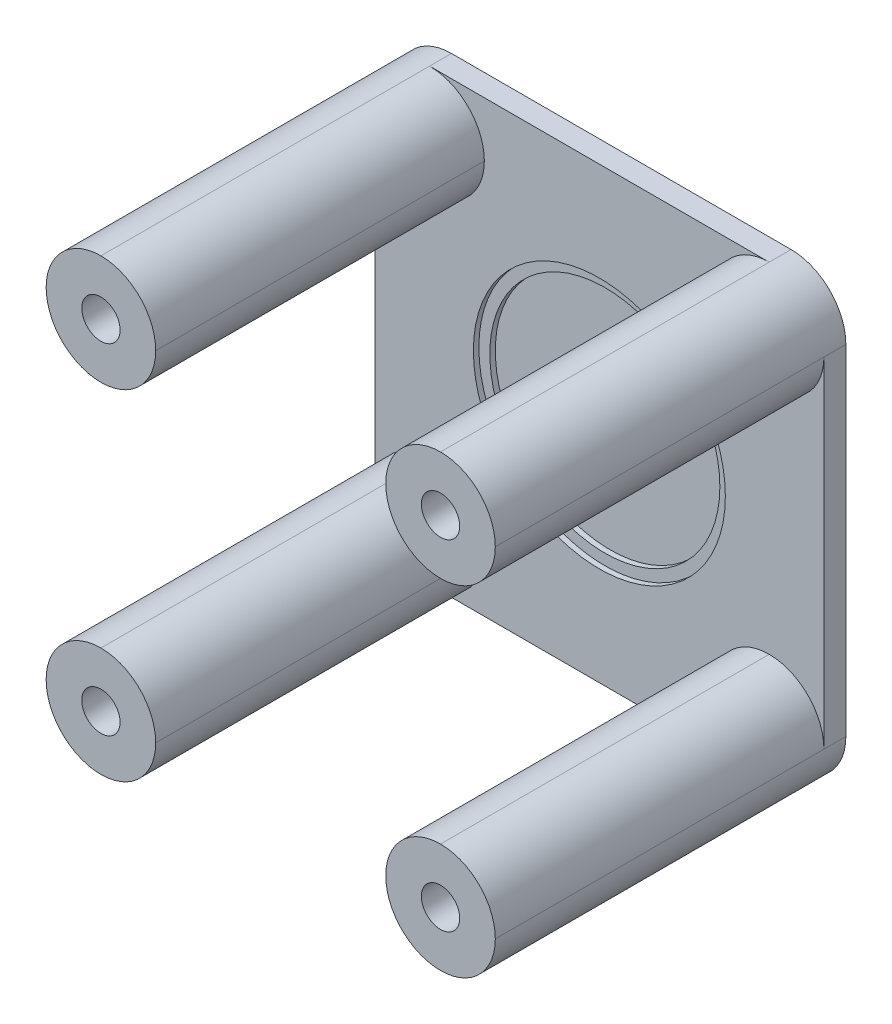
ISO-10303-21;
HEADER;
FILE_DESCRIPTION(('STEP AP214'),'2;1');
FILE_NAME('part.step','',(''),(''),'','','');
FILE_SCHEMA(('AUTOMOTIVE_DESIGN { 1 0 10303 214 1 1 1 1 }'));
ENDSEC;
DATA;
#1=APPLICATION_CONTEXT('core data for automotive mechanical design processes');
#2=APPLICATION_PROTOCOL_DEFINITION('international standard','automotive_design',2000,#1);
#3=PRODUCT_CONTEXT('',#1,'mechanical');
#4=PRODUCT('Part','Part','',(#3));
#5=PRODUCT_RELATED_PRODUCT_CATEGORY('part','',(#4));
#6=PRODUCT_DEFINITION_FORMATION('','',#4);
#7=PRODUCT_DEFINITION_CONTEXT('part definition',#1,'design');
#8=PRODUCT_DEFINITION('design','',#6,#7);
#9=PRODUCT_DEFINITION_SHAPE('','',#8);
#10=(LENGTH_UNIT() NAMED_UNIT(*) SI_UNIT(.MILLI.,.METRE.));
#11=(NAMED_UNIT(*) PLANE_ANGLE_UNIT() SI_UNIT($,.RADIAN.));
#12=(NAMED_UNIT(*) SI_UNIT($,.STERADIAN.) SOLID_ANGLE_UNIT());
#13=UNCERTAINTY_MEASURE_WITH_UNIT(LENGTH_MEASURE(1.E-05),#10,'distance_accuracy_value','');
#14=(GEOMETRIC_REPRESENTATION_CONTEXT(3) GLOBAL_UNCERTAINTY_ASSIGNED_CONTEXT((#13)) GLOBAL_UNIT_ASSIGNED_CONTEXT((#10,
#11,#12)) REPRESENTATION_CONTEXT('',''));
#15=CARTESIAN_POINT('',(0.,0.,0.));
#16=DIRECTION('',(0.,0.,1.));
#17=DIRECTION('',(1.,0.,0.));
#18=AXIS2_PLACEMENT_3D('',#15,#16,#17);
#19=CARTESIAN_POINT('',(-34.5083333333333,4.35624999999999,1.));
#20=DIRECTION('',(0.,0.,1.));
#21=DIRECTION('',(1.,0.,0.));
#22=AXIS2_PLACEMENT_3D('',#19,#20,#21);
#23=CYLINDRICAL_SURFACE('',#22,10.5);
#24=CARTESIAN_POINT('',(-34.5083333333333,4.35624999999999,1.));
#25=DIRECTION('',(0.,0.,1.));
#26=DIRECTION('',(1.,0.,0.));
#27=AXIS2_PLACEMENT_3D('',#24,#25,#26);
#28=CIRCLE('',#27,10.5);
#29=CARTESIAN_POINT('',(-24.0083333333333,4.35624999999999,1.));
#30=VERTEX_POINT('',#29);
#31=EDGE_CURVE('E314',#30,#30,#28,.T.);
#32=ORIENTED_EDGE('',*,*,#31,.F.);
#33=EDGE_LOOP('',(#32));
#34=FACE_BOUND('',#33,.T.);
#35=CARTESIAN_POINT('',(-34.5083333333333,4.35624999999999,1.5));
#36=DIRECTION('',(0.,0.,1.));
#37=DIRECTION('',(1.,0.,0.));
#38=AXIS2_PLACEMENT_3D('',#35,#36,#37);
#39=CIRCLE('',#38,10.5);
#40=CARTESIAN_POINT('',(-24.0083333333333,4.35624999999999,1.5));
#41=VERTEX_POINT('',#40);
#42=EDGE_CURVE('E42',#41,#41,#39,.F.);
#43=ORIENTED_EDGE('',*,*,#42,.F.);
#44=EDGE_LOOP('',(#43));
#45=FACE_BOUND('',#44,.T.);
#46=ADVANCED_FACE('F38',(#34,#45),#23,.F.);
#47=CARTESIAN_POINT('',(-34.5083333333333,4.35624999999999,2.));
#48=DIRECTION('',(0.,0.,-1.));
#49=DIRECTION('',(-1.,0.,0.));
#50=AXIS2_PLACEMENT_3D('',#47,#48,#49);
#51=CYLINDRICAL_SURFACE('',#50,1.25);
#52=CARTESIAN_POINT('',(-34.5083333333333,4.35624999999999,0.));
#53=DIRECTION('',(0.,0.,1.));
#54=DIRECTION('',(1.,0.,0.));
#55=AXIS2_PLACEMENT_3D('',#52,#53,#54);
#56=CIRCLE('',#55,1.25);
#57=CARTESIAN_POINT('',(-33.2583333333333,4.35624999999999,0.));
#58=VERTEX_POINT('',#57);
#59=EDGE_CURVE('E344',#58,#58,#56,.T.);
#60=ORIENTED_EDGE('',*,*,#59,.F.);
#61=EDGE_LOOP('',(#60));
#62=FACE_BOUND('',#61,.T.);
#63=CARTESIAN_POINT('',(-34.5083333333333,4.35624999999999,1.));
#64=DIRECTION('',(0.,0.,1.));
#65=DIRECTION('',(1.,0.,0.));
#66=AXIS2_PLACEMENT_3D('',#63,#64,#65);
#67=CIRCLE('',#66,1.25);
#68=CARTESIAN_POINT('',(-33.2583333333333,4.35624999999999,1.));
#69=VERTEX_POINT('',#68);
#70=EDGE_CURVE('E302',#69,#69,#67,.T.);
#71=ORIENTED_EDGE('',*,*,#70,.T.);
#72=EDGE_LOOP('',(#71));
#73=FACE_BOUND('',#72,.T.);
#74=ADVANCED_FACE('F519',(#62,#73),#51,.F.);
#75=CARTESIAN_POINT('',(0.,0.,2.));
#76=DIRECTION('',(0.,0.,1.));
#77=DIRECTION('',(1.,0.,0.));
#78=AXIS2_PLACEMENT_3D('',#75,#76,#77);
#79=PLANE('',#78);
#80=CARTESIAN_POINT('',(-34.5083333333333,4.35624999999999,2.));
#81=DIRECTION('',(0.,0.,1.));
#82=DIRECTION('',(1.,0.,0.));
#83=AXIS2_PLACEMENT_3D('',#80,#81,#82);
#84=CIRCLE('',#83,11.5);
#85=CARTESIAN_POINT('',(-23.0083333333333,4.35624999999999,2.));
#86=VERTEX_POINT('',#85);
#87=EDGE_CURVE('E327',#86,#86,#84,.T.);
#88=ORIENTED_EDGE('',*,*,#87,.F.);
#89=EDGE_LOOP('',(#88));
#90=FACE_BOUND('',#89,.T.);
#91=CARTESIAN_POINT('',(-19.0083333333333,19.85625,2.));
#92=DIRECTION('',(0.,0.,1.));
#93=DIRECTION('',(1.,0.,0.));
#94=AXIS2_PLACEMENT_3D('',#91,#92,#93);
#95=CIRCLE('',#94,5.);
#96=CARTESIAN_POINT('',(-14.0083333333333,19.85625,2.));
#97=VERTEX_POINT('',#96);
#98=CARTESIAN_POINT('',(-19.0083333333333,14.85625,2.));
#99=VERTEX_POINT('',#98);
#100=EDGE_CURVE('E56',#97,#99,#95,.F.);
#101=ORIENTED_EDGE('',*,*,#100,.T.);
#102=CARTESIAN_POINT('',(-19.0083333333333,19.85625,2.));
#103=DIRECTION('',(0.,0.,1.));
#104=DIRECTION('',(1.,0.,0.));
#105=AXIS2_PLACEMENT_3D('',#102,#103,#104);
#106=CIRCLE('',#105,5.);
#107=CARTESIAN_POINT('',(-24.0083333333333,19.85625,2.));
#108=VERTEX_POINT('',#107);
#109=EDGE_CURVE('E48',#99,#108,#106,.F.);
#110=ORIENTED_EDGE('',*,*,#109,.T.);
#111=CARTESIAN_POINT('',(-19.0083333333333,19.85625,2.));
#112=DIRECTION('',(0.,0.,1.));
#113=DIRECTION('',(1.,0.,0.));
#114=AXIS2_PLACEMENT_3D('',#111,#112,#113);
#115=CIRCLE('',#114,5.);
#116=CARTESIAN_POINT('',(-19.0083333333333,24.85625,2.));
#117=VERTEX_POINT('',#116);
#118=EDGE_CURVE('E218',#108,#117,#115,.F.);
#119=ORIENTED_EDGE('',*,*,#118,.T.);
#120=DIRECTION('',(-1.,0.,0.));
#121=VECTOR('',#120,1.);
#122=CARTESIAN_POINT('',(-55.0083333333333,24.85625,2.));
#123=LINE('',#122,#121);
#124=CARTESIAN_POINT('',(-50.0083333333333,24.85625,2.));
#125=VERTEX_POINT('',#124);
#126=EDGE_CURVE('E184',#117,#125,#123,.T.);
#127=ORIENTED_EDGE('',*,*,#126,.T.);
#128=CARTESIAN_POINT('',(-50.0083333333333,19.85625,2.));
#129=DIRECTION('',(0.,0.,1.));
#130=DIRECTION('',(1.,0.,0.));
#131=AXIS2_PLACEMENT_3D('',#128,#129,#130);
#132=CIRCLE('',#131,5.);
#133=CARTESIAN_POINT('',(-45.0083333333333,19.85625,2.));
#134=VERTEX_POINT('',#133);
#135=EDGE_CURVE('E236',#125,#134,#132,.F.);
#136=ORIENTED_EDGE('',*,*,#135,.T.);
#137=CARTESIAN_POINT('',(-50.0083333333333,19.85625,2.));
#138=DIRECTION('',(0.,0.,1.));
#139=DIRECTION('',(1.,0.,0.));
#140=AXIS2_PLACEMENT_3D('',#137,#138,#139);
#141=CIRCLE('',#140,5.);
#142=CARTESIAN_POINT('',(-50.0083333333333,14.85625,2.));
#143=VERTEX_POINT('',#142);
#144=EDGE_CURVE('E11',#134,#143,#141,.F.);
#145=ORIENTED_EDGE('',*,*,#144,.T.);
#146=CARTESIAN_POINT('',(-50.0083333333333,19.85625,2.));
#147=DIRECTION('',(0.,0.,1.));
#148=DIRECTION('',(1.,0.,0.));
#149=AXIS2_PLACEMENT_3D('',#146,#147,#148);
#150=CIRCLE('',#149,5.);
#151=CARTESIAN_POINT('',(-55.0083333333333,19.85625,2.));
#152=VERTEX_POINT('',#151);
#153=EDGE_CURVE('E232',#143,#152,#150,.F.);
#154=ORIENTED_EDGE('',*,*,#153,.T.);
#155=DIRECTION('',(0.,-1.,0.));
#156=VECTOR('',#155,1.);
#157=CARTESIAN_POINT('',(-55.0083333333333,24.85625,2.));
#158=LINE('',#157,#156);
#159=CARTESIAN_POINT('',(-55.0083333333333,-11.14375,2.));
#160=VERTEX_POINT('',#159);
#161=EDGE_CURVE('E204',#152,#160,#158,.T.);
#162=ORIENTED_EDGE('',*,*,#161,.T.);
#163=CARTESIAN_POINT('',(-50.0083333333333,-11.14375,2.));
#164=DIRECTION('',(0.,0.,1.));
#165=DIRECTION('',(1.,0.,0.));
#166=AXIS2_PLACEMENT_3D('',#163,#164,#165);
#167=CIRCLE('',#166,5.);
#168=CARTESIAN_POINT('',(-50.0083333333333,-6.14375000000001,2.));
#169=VERTEX_POINT('',#168);
#170=EDGE_CURVE('E229',#160,#169,#167,.F.);
#171=ORIENTED_EDGE('',*,*,#170,.T.);
#172=CARTESIAN_POINT('',(-50.0083333333333,-11.14375,2.));
#173=DIRECTION('',(0.,0.,1.));
#174=DIRECTION('',(1.,0.,0.));
#175=AXIS2_PLACEMENT_3D('',#172,#173,#174);
#176=CIRCLE('',#175,5.);
#177=CARTESIAN_POINT('',(-45.0083333333333,-11.14375,2.));
#178=VERTEX_POINT('',#177);
#179=EDGE_CURVE('E63',#169,#178,#176,.F.);
#180=ORIENTED_EDGE('',*,*,#179,.T.);
#181=CARTESIAN_POINT('',(-50.0083333333333,-11.14375,2.));
#182=DIRECTION('',(0.,0.,1.));
#183=DIRECTION('',(1.,0.,0.));
#184=AXIS2_PLACEMENT_3D('',#181,#182,#183);
#185=CIRCLE('',#184,5.);
#186=CARTESIAN_POINT('',(-50.0083333333333,-16.14375,2.));
#187=VERTEX_POINT('',#186);
#188=EDGE_CURVE('E241',#178,#187,#185,.F.);
#189=ORIENTED_EDGE('',*,*,#188,.T.);
#190=DIRECTION('',(1.,0.,0.));
#191=VECTOR('',#190,1.);
#192=CARTESIAN_POINT('',(-55.0083333333333,-16.14375,2.));
#193=LINE('',#192,#191);
#194=CARTESIAN_POINT('',(-19.0083333333333,-16.14375,2.));
#195=VERTEX_POINT('',#194);
#196=EDGE_CURVE('E367',#187,#195,#193,.T.);
#197=ORIENTED_EDGE('',*,*,#196,.T.);
#198=CARTESIAN_POINT('',(-19.0083333333333,-11.14375,2.));
#199=DIRECTION('',(0.,0.,1.));
#200=DIRECTION('',(1.,0.,0.));
#201=AXIS2_PLACEMENT_3D('',#198,#199,#200);
#202=CIRCLE('',#201,5.);
#203=CARTESIAN_POINT('',(-24.0083333333333,-11.14375,2.));
#204=VERTEX_POINT('',#203);
#205=EDGE_CURVE('E244',#195,#204,#202,.F.);
#206=ORIENTED_EDGE('',*,*,#205,.T.);
#207=CARTESIAN_POINT('',(-19.0083333333333,-11.14375,2.));
#208=DIRECTION('',(0.,0.,1.));
#209=DIRECTION('',(1.,0.,0.));
#210=AXIS2_PLACEMENT_3D('',#207,#208,#209);
#211=CIRCLE('',#210,5.);
#212=CARTESIAN_POINT('',(-19.0083333333333,-6.14375000000001,2.));
#213=VERTEX_POINT('',#212);
#214=EDGE_CURVE('E225',#204,#213,#211,.F.);
#215=ORIENTED_EDGE('',*,*,#214,.T.);
#216=CARTESIAN_POINT('',(-19.0083333333333,-11.14375,2.));
#217=DIRECTION('',(0.,0.,1.));
#218=DIRECTION('',(1.,0.,0.));
#219=AXIS2_PLACEMENT_3D('',#216,#217,#218);
#220=CIRCLE('',#219,5.);
#221=CARTESIAN_POINT('',(-14.0083333333333,-11.14375,2.));
#222=VERTEX_POINT('',#221);
#223=EDGE_CURVE('E247',#213,#222,#220,.F.);
#224=ORIENTED_EDGE('',*,*,#223,.T.);
#225=DIRECTION('',(0.,1.,0.));
#226=VECTOR('',#225,1.);
#227=CARTESIAN_POINT('',(-14.0083333333333,24.85625,2.));
#228=LINE('',#227,#226);
#229=EDGE_CURVE('E370',#222,#97,#228,.T.);
#230=ORIENTED_EDGE('',*,*,#229,.T.);
#231=EDGE_LOOP('',(#101,#110,#119,#127,#136,#145,#154,#162,#171,#180,#189,#197,#206,#215,#224,#230));
#232=FACE_BOUND('',#231,.T.);
#233=ADVANCED_FACE('F491',(#90,#232),#79,.T.);
#234=CARTESIAN_POINT('',(0.,0.,0.));
#235=DIRECTION('',(0.,0.,1.));
#236=DIRECTION('',(1.,0.,0.));
#237=AXIS2_PLACEMENT_3D('',#234,#235,#236);
#238=PLANE('',#237);
#239=DIRECTION('',(0.,1.,0.));
#240=VECTOR('',#239,1.);
#241=CARTESIAN_POINT('',(-14.0083333333333,24.85625,0.));
#242=LINE('',#241,#240);
#243=CARTESIAN_POINT('',(-14.0083333333333,-11.14375,0.));
#244=VERTEX_POINT('',#243);
#245=CARTESIAN_POINT('',(-14.0083333333333,19.85625,0.));
#246=VERTEX_POINT('',#245);
#247=EDGE_CURVE('E205',#244,#246,#242,.T.);
#248=ORIENTED_EDGE('',*,*,#247,.F.);
#249=CARTESIAN_POINT('',(-19.0083333333333,-11.14375,0.));
#250=DIRECTION('',(0.,0.,1.));
#251=DIRECTION('',(1.,0.,0.));
#252=AXIS2_PLACEMENT_3D('',#249,#250,#251);
#253=CIRCLE('',#252,5.);
#254=CARTESIAN_POINT('',(-19.0083333333333,-16.14375,0.));
#255=VERTEX_POINT('',#254);
#256=EDGE_CURVE('E213',#244,#255,#253,.F.);
#257=ORIENTED_EDGE('',*,*,#256,.T.);
#258=DIRECTION('',(1.,0.,0.));
#259=VECTOR('',#258,1.);
#260=CARTESIAN_POINT('',(-55.0083333333333,-16.14375,0.));
#261=LINE('',#260,#259);
#262=CARTESIAN_POINT('',(-50.0083333333333,-16.14375,0.));
#263=VERTEX_POINT('',#262);
#264=EDGE_CURVE('E378',#263,#255,#261,.T.);
#265=ORIENTED_EDGE('',*,*,#264,.F.);
#266=CARTESIAN_POINT('',(-50.0083333333333,-11.14375,0.));
#267=DIRECTION('',(0.,0.,1.));
#268=DIRECTION('',(1.,0.,0.));
#269=AXIS2_PLACEMENT_3D('',#266,#267,#268);
#270=CIRCLE('',#269,5.);
#271=CARTESIAN_POINT('',(-55.0083333333333,-11.14375,0.));
#272=VERTEX_POINT('',#271);
#273=EDGE_CURVE('E214',#263,#272,#270,.F.);
#274=ORIENTED_EDGE('',*,*,#273,.T.);
#275=DIRECTION('',(0.,-1.,0.));
#276=VECTOR('',#275,1.);
#277=CARTESIAN_POINT('',(-55.0083333333333,24.85625,0.));
#278=LINE('',#277,#276);
#279=CARTESIAN_POINT('',(-55.0083333333333,19.85625,0.));
#280=VERTEX_POINT('',#279);
#281=EDGE_CURVE('E364',#280,#272,#278,.T.);
#282=ORIENTED_EDGE('',*,*,#281,.F.);
#283=CARTESIAN_POINT('',(-50.0083333333333,19.85625,0.));
#284=DIRECTION('',(0.,0.,1.));
#285=DIRECTION('',(1.,0.,0.));
#286=AXIS2_PLACEMENT_3D('',#283,#284,#285);
#287=CIRCLE('',#286,5.);
#288=CARTESIAN_POINT('',(-50.0083333333333,24.85625,0.));
#289=VERTEX_POINT('',#288);
#290=EDGE_CURVE('E202',#280,#289,#287,.F.);
#291=ORIENTED_EDGE('',*,*,#290,.T.);
#292=DIRECTION('',(-1.,0.,0.));
#293=VECTOR('',#292,1.);
#294=CARTESIAN_POINT('',(-55.0083333333333,24.85625,0.));
#295=LINE('',#294,#293);
#296=CARTESIAN_POINT('',(-19.0083333333333,24.85625,0.));
#297=VERTEX_POINT('',#296);
#298=EDGE_CURVE('E182',#297,#289,#295,.T.);
#299=ORIENTED_EDGE('',*,*,#298,.F.);
#300=CARTESIAN_POINT('',(-19.0083333333333,19.85625,0.));
#301=DIRECTION('',(0.,0.,1.));
#302=DIRECTION('',(1.,0.,0.));
#303=AXIS2_PLACEMENT_3D('',#300,#301,#302);
#304=CIRCLE('',#303,5.);
#305=EDGE_CURVE('E198',#297,#246,#304,.F.);
#306=ORIENTED_EDGE('',*,*,#305,.T.);
#307=EDGE_LOOP('',(#248,#257,#265,#274,#282,#291,#299,#306));
#308=FACE_BOUND('',#307,.T.);
#309=CARTESIAN_POINT('',(-50.0083333333333,19.85625,0.));
#310=DIRECTION('',(0.,0.,1.));
#311=DIRECTION('',(1.,0.,0.));
#312=AXIS2_PLACEMENT_3D('',#309,#310,#311);
#313=CIRCLE('',#312,1.75);
#314=CARTESIAN_POINT('',(-48.2583333333333,19.85625,0.));
#315=VERTEX_POINT('',#314);
#316=EDGE_CURVE('E360',#315,#315,#313,.T.);
#317=ORIENTED_EDGE('',*,*,#316,.T.);
#318=EDGE_LOOP('',(#317));
#319=FACE_BOUND('',#318,.T.);
#320=CARTESIAN_POINT('',(-50.0083333333333,-11.14375,0.));
#321=DIRECTION('',(0.,0.,1.));
#322=DIRECTION('',(1.,0.,0.));
#323=AXIS2_PLACEMENT_3D('',#320,#321,#322);
#324=CIRCLE('',#323,1.75);
#325=CARTESIAN_POINT('',(-48.2583333333333,-11.14375,0.));
#326=VERTEX_POINT('',#325);
#327=EDGE_CURVE('E356',#326,#326,#324,.T.);
#328=ORIENTED_EDGE('',*,*,#327,.T.);
#329=EDGE_LOOP('',(#328));
#330=FACE_BOUND('',#329,.T.);
#331=CARTESIAN_POINT('',(-19.0083333333333,-11.14375,0.));
#332=DIRECTION('',(0.,0.,1.));
#333=DIRECTION('',(1.,0.,0.));
#334=AXIS2_PLACEMENT_3D('',#331,#332,#333);
#335=CIRCLE('',#334,1.75);
#336=CARTESIAN_POINT('',(-17.2583333333333,-11.14375,0.));
#337=VERTEX_POINT('',#336);
#338=EDGE_CURVE('E352',#337,#337,#335,.T.);
#339=ORIENTED_EDGE('',*,*,#338,.T.);
#340=EDGE_LOOP('',(#339));
#341=FACE_BOUND('',#340,.T.);
#342=CARTESIAN_POINT('',(-19.0083333333333,19.85625,0.));
#343=DIRECTION('',(0.,0.,1.));
#344=DIRECTION('',(1.,0.,0.));
#345=AXIS2_PLACEMENT_3D('',#342,#343,#344);
#346=CIRCLE('',#345,1.75);
#347=CARTESIAN_POINT('',(-17.2583333333333,19.85625,0.));
#348=VERTEX_POINT('',#347);
#349=EDGE_CURVE('E348',#348,#348,#346,.T.);
#350=ORIENTED_EDGE('',*,*,#349,.T.);
#351=EDGE_LOOP('',(#350));
#352=FACE_BOUND('',#351,.T.);
#353=ORIENTED_EDGE('',*,*,#59,.T.);
#354=EDGE_LOOP('',(#353));
#355=FACE_BOUND('',#354,.T.);
#356=ADVANCED_FACE('F196',(#308,#319,#330,#341,#352,#355),#238,.F.);
#357=CARTESIAN_POINT('',(-55.0083333333333,24.85625,2.));
#358=DIRECTION('',(1.,0.,0.));
#359=DIRECTION('',(0.,1.,0.));
#360=AXIS2_PLACEMENT_3D('',#357,#358,#359);
#361=PLANE('',#360);
#362=DIRECTION('',(0.,0.,-1.));
#363=VECTOR('',#362,1.);
#364=CARTESIAN_POINT('',(-55.0083333333333,-11.14375,2.));
#365=LINE('',#364,#363);
#366=EDGE_CURVE('E414',#272,#160,#365,.F.);
#367=ORIENTED_EDGE('',*,*,#366,.T.);
#368=ORIENTED_EDGE('',*,*,#161,.F.);
#369=DIRECTION('',(0.,0.,-1.));
#370=VECTOR('',#369,1.);
#371=CARTESIAN_POINT('',(-55.0083333333333,19.85625,2.));
#372=LINE('',#371,#370);
#373=EDGE_CURVE('E411',#152,#280,#372,.T.);
#374=ORIENTED_EDGE('',*,*,#373,.T.);
#375=ORIENTED_EDGE('',*,*,#281,.T.);
#376=EDGE_LOOP('',(#367,#368,#374,#375));
#377=FACE_BOUND('',#376,.T.);
#378=ADVANCED_FACE('F479',(#377),#361,.F.);
#379=CARTESIAN_POINT('',(-55.0083333333333,-16.14375,2.));
#380=DIRECTION('',(0.,1.,0.));
#381=DIRECTION('',(0.,0.,1.));
#382=AXIS2_PLACEMENT_3D('',#379,#380,#381);
#383=PLANE('',#382);
#384=DIRECTION('',(0.,0.,-1.));
#385=VECTOR('',#384,1.);
#386=CARTESIAN_POINT('',(-19.0083333333333,-16.14375,2.));
#387=LINE('',#386,#385);
#388=EDGE_CURVE('E447',#255,#195,#387,.F.);
#389=ORIENTED_EDGE('',*,*,#388,.T.);
#390=ORIENTED_EDGE('',*,*,#196,.F.);
#391=DIRECTION('',(0.,0.,-1.));
#392=VECTOR('',#391,1.);
#393=CARTESIAN_POINT('',(-50.0083333333333,-16.14375,2.));
#394=LINE('',#393,#392);
#395=EDGE_CURVE('E444',#187,#263,#394,.T.);
#396=ORIENTED_EDGE('',*,*,#395,.T.);
#397=ORIENTED_EDGE('',*,*,#264,.T.);
#398=EDGE_LOOP('',(#389,#390,#396,#397));
#399=FACE_BOUND('',#398,.T.);
#400=ADVANCED_FACE('F469',(#399),#383,.F.);
#401=CARTESIAN_POINT('',(-14.0083333333333,24.85625,2.));
#402=DIRECTION('',(-1.,0.,0.));
#403=DIRECTION('',(0.,-1.,0.));
#404=AXIS2_PLACEMENT_3D('',#401,#402,#403);
#405=PLANE('',#404);
#406=ORIENTED_EDGE('',*,*,#229,.F.);
#407=DIRECTION('',(0.,0.,-1.));
#408=VECTOR('',#407,1.);
#409=CARTESIAN_POINT('',(-14.0083333333333,-11.14375,2.));
#410=LINE('',#409,#408);
#411=EDGE_CURVE('E453',#222,#244,#410,.T.);
#412=ORIENTED_EDGE('',*,*,#411,.T.);
#413=ORIENTED_EDGE('',*,*,#247,.T.);
#414=DIRECTION('',(0.,0.,-1.));
#415=VECTOR('',#414,1.);
#416=CARTESIAN_POINT('',(-14.0083333333333,19.85625,2.));
#417=LINE('',#416,#415);
#418=EDGE_CURVE('E211',#246,#97,#417,.F.);
#419=ORIENTED_EDGE('',*,*,#418,.T.);
#420=EDGE_LOOP('',(#406,#412,#413,#419));
#421=FACE_BOUND('',#420,.T.);
#422=ADVANCED_FACE('F458',(#421),#405,.F.);
#423=CARTESIAN_POINT('',(-55.0083333333333,24.85625,2.));
#424=DIRECTION('',(0.,-1.,0.));
#425=DIRECTION('',(0.,0.,-1.));
#426=AXIS2_PLACEMENT_3D('',#423,#424,#425);
#427=PLANE('',#426);
#428=ORIENTED_EDGE('',*,*,#126,.F.);
#429=DIRECTION('',(0.,0.,-1.));
#430=VECTOR('',#429,1.);
#431=CARTESIAN_POINT('',(-19.0083333333333,24.85625,2.));
#432=LINE('',#431,#430);
#433=EDGE_CURVE('E178',#117,#297,#432,.T.);
#434=ORIENTED_EDGE('',*,*,#433,.T.);
#435=ORIENTED_EDGE('',*,*,#298,.T.);
#436=DIRECTION('',(0.,0.,-1.));
#437=VECTOR('',#436,1.);
#438=CARTESIAN_POINT('',(-50.0083333333333,24.85625,2.));
#439=LINE('',#438,#437);
#440=EDGE_CURVE('E192',#289,#125,#439,.F.);
#441=ORIENTED_EDGE('',*,*,#440,.T.);
#442=EDGE_LOOP('',(#428,#434,#435,#441));
#443=FACE_BOUND('',#442,.T.);
#444=ADVANCED_FACE('F180',(#443),#427,.F.);
#445=CARTESIAN_POINT('',(-50.0083333333333,19.85625,2.));
#446=DIRECTION('',(0.,0.,-1.));
#447=DIRECTION('',(-1.,0.,0.));
#448=AXIS2_PLACEMENT_3D('',#445,#446,#447);
#449=CYLINDRICAL_SURFACE('',#448,1.75);
#450=ORIENTED_EDGE('',*,*,#316,.F.);
#451=EDGE_LOOP('',(#450));
#452=FACE_BOUND('',#451,.T.);
#453=CARTESIAN_POINT('',(-50.0083333333333,19.85625,32.));
#454=DIRECTION('',(0.,0.,1.));
#455=DIRECTION('',(1.,0.,0.));
#456=AXIS2_PLACEMENT_3D('',#453,#454,#455);
#457=CIRCLE('',#456,1.75);
#458=CARTESIAN_POINT('',(-48.2583333333333,19.85625,32.));
#459=VERTEX_POINT('',#458);
#460=EDGE_CURVE('E340',#459,#459,#457,.T.);
#461=ORIENTED_EDGE('',*,*,#460,.T.);
#462=EDGE_LOOP('',(#461));
#463=FACE_BOUND('',#462,.T.);
#464=ADVANCED_FACE('F559',(#452,#463),#449,.F.);
#465=CARTESIAN_POINT('',(-50.0083333333333,-11.14375,2.));
#466=DIRECTION('',(0.,0.,-1.));
#467=DIRECTION('',(-1.,0.,0.));
#468=AXIS2_PLACEMENT_3D('',#465,#466,#467);
#469=CYLINDRICAL_SURFACE('',#468,1.75);
#470=ORIENTED_EDGE('',*,*,#327,.F.);
#471=EDGE_LOOP('',(#470));
#472=FACE_BOUND('',#471,.T.);
#473=CARTESIAN_POINT('',(-50.0083333333333,-11.14375,32.));
#474=DIRECTION('',(0.,0.,1.));
#475=DIRECTION('',(1.,0.,0.));
#476=AXIS2_PLACEMENT_3D('',#473,#474,#475);
#477=CIRCLE('',#476,1.75);
#478=CARTESIAN_POINT('',(-48.2583333333333,-11.14375,32.));
#479=VERTEX_POINT('',#478);
#480=EDGE_CURVE('E336',#479,#479,#477,.T.);
#481=ORIENTED_EDGE('',*,*,#480,.T.);
#482=EDGE_LOOP('',(#481));
#483=FACE_BOUND('',#482,.T.);
#484=ADVANCED_FACE('F555',(#472,#483),#469,.F.);
#485=CARTESIAN_POINT('',(-19.0083333333333,-11.14375,2.));
#486=DIRECTION('',(0.,0.,-1.));
#487=DIRECTION('',(-1.,0.,0.));
#488=AXIS2_PLACEMENT_3D('',#485,#486,#487);
#489=CYLINDRICAL_SURFACE('',#488,1.75);
#490=ORIENTED_EDGE('',*,*,#338,.F.);
#491=EDGE_LOOP('',(#490));
#492=FACE_BOUND('',#491,.T.);
#493=CARTESIAN_POINT('',(-19.0083333333333,-11.14375,32.));
#494=DIRECTION('',(0.,0.,1.));
#495=DIRECTION('',(1.,0.,0.));
#496=AXIS2_PLACEMENT_3D('',#493,#494,#495);
#497=CIRCLE('',#496,1.75);
#498=CARTESIAN_POINT('',(-17.2583333333333,-11.14375,32.));
#499=VERTEX_POINT('',#498);
#500=EDGE_CURVE('E332',#499,#499,#497,.T.);
#501=ORIENTED_EDGE('',*,*,#500,.T.);
#502=EDGE_LOOP('',(#501));
#503=FACE_BOUND('',#502,.T.);
#504=ADVANCED_FACE('F551',(#492,#503),#489,.F.);
#505=CARTESIAN_POINT('',(-19.0083333333333,19.85625,2.));
#506=DIRECTION('',(0.,0.,-1.));
#507=DIRECTION('',(-1.,0.,0.));
#508=AXIS2_PLACEMENT_3D('',#505,#506,#507);
#509=CYLINDRICAL_SURFACE('',#508,1.75);
#510=ORIENTED_EDGE('',*,*,#349,.F.);
#511=EDGE_LOOP('',(#510));
#512=FACE_BOUND('',#511,.T.);
#513=CARTESIAN_POINT('',(-19.0083333333333,19.85625,32.));
#514=DIRECTION('',(0.,0.,1.));
#515=DIRECTION('',(1.,0.,0.));
#516=AXIS2_PLACEMENT_3D('',#513,#514,#515);
#517=CIRCLE('',#516,1.75);
#518=CARTESIAN_POINT('',(-17.2583333333333,19.85625,32.));
#519=VERTEX_POINT('',#518);
#520=EDGE_CURVE('E269',#519,#519,#517,.T.);
#521=ORIENTED_EDGE('',*,*,#520,.T.);
#522=EDGE_LOOP('',(#521));
#523=FACE_BOUND('',#522,.T.);
#524=ADVANCED_FACE('F546',(#512,#523),#509,.F.);
#525=CARTESIAN_POINT('',(0.,0.,32.));
#526=DIRECTION('',(0.,0.,1.));
#527=DIRECTION('',(1.,0.,0.));
#528=AXIS2_PLACEMENT_3D('',#525,#526,#527);
#529=PLANE('',#528);
#530=CARTESIAN_POINT('',(-50.0083333333333,19.85625,32.));
#531=DIRECTION('',(0.,0.,1.));
#532=DIRECTION('',(1.,0.,0.));
#533=AXIS2_PLACEMENT_3D('',#530,#531,#532);
#534=CIRCLE('',#533,5.);
#535=CARTESIAN_POINT('',(-55.0083333333333,19.85625,32.));
#536=VERTEX_POINT('',#535);
#537=CARTESIAN_POINT('',(-50.0083333333333,14.85625,32.));
#538=VERTEX_POINT('',#537);
#539=EDGE_CURVE('E437',#536,#538,#534,.T.);
#540=ORIENTED_EDGE('',*,*,#539,.T.);
#541=CARTESIAN_POINT('',(-50.0083333333333,19.85625,32.));
#542=DIRECTION('',(0.,0.,1.));
#543=DIRECTION('',(1.,0.,0.));
#544=AXIS2_PLACEMENT_3D('',#541,#542,#543);
#545=CIRCLE('',#544,5.);
#546=CARTESIAN_POINT('',(-45.0083333333333,19.85625,32.));
#547=VERTEX_POINT('',#546);
#548=EDGE_CURVE('E441',#538,#547,#545,.T.);
#549=ORIENTED_EDGE('',*,*,#548,.T.);
#550=CARTESIAN_POINT('',(-50.0083333333333,19.85625,32.));
#551=DIRECTION('',(0.,0.,1.));
#552=DIRECTION('',(1.,0.,0.));
#553=AXIS2_PLACEMENT_3D('',#550,#551,#552);
#554=CIRCLE('',#553,5.);
#555=CARTESIAN_POINT('',(-50.0083333333333,24.85625,32.));
#556=VERTEX_POINT('',#555);
#557=EDGE_CURVE('E434',#547,#556,#554,.T.);
#558=ORIENTED_EDGE('',*,*,#557,.T.);
#559=CARTESIAN_POINT('',(-50.0083333333333,19.85625,32.));
#560=DIRECTION('',(0.,0.,1.));
#561=DIRECTION('',(1.,0.,0.));
#562=AXIS2_PLACEMENT_3D('',#559,#560,#561);
#563=CIRCLE('',#562,5.);
#564=EDGE_CURVE('E431',#556,#536,#563,.T.);
#565=ORIENTED_EDGE('',*,*,#564,.T.);
#566=EDGE_LOOP('',(#540,#549,#558,#565));
#567=FACE_BOUND('',#566,.T.);
#568=ORIENTED_EDGE('',*,*,#460,.F.);
#569=EDGE_LOOP('',(#568));
#570=FACE_BOUND('',#569,.T.);
#571=ADVANCED_FACE('F543',(#567,#570),#529,.T.);
#572=CARTESIAN_POINT('',(0.,0.,32.));
#573=DIRECTION('',(0.,0.,-1.));
#574=DIRECTION('',(-1.,0.,0.));
#575=AXIS2_PLACEMENT_3D('',#572,#573,#574);
#576=PLANE('',#575);
#577=CARTESIAN_POINT('',(-50.0083333333333,-11.14375,32.));
#578=DIRECTION('',(0.,0.,-1.));
#579=DIRECTION('',(-1.,0.,0.));
#580=AXIS2_PLACEMENT_3D('',#577,#578,#579);
#581=CIRCLE('',#580,5.);
#582=CARTESIAN_POINT('',(-45.0083333333333,-11.14375,32.));
#583=VERTEX_POINT('',#582);
#584=CARTESIAN_POINT('',(-50.0083333333333,-6.14375000000001,32.));
#585=VERTEX_POINT('',#584);
#586=EDGE_CURVE('E424',#583,#585,#581,.F.);
#587=ORIENTED_EDGE('',*,*,#586,.T.);
#588=CARTESIAN_POINT('',(-50.0083333333333,-11.14375,32.));
#589=DIRECTION('',(0.,0.,-1.));
#590=DIRECTION('',(-1.,0.,0.));
#591=AXIS2_PLACEMENT_3D('',#588,#589,#590);
#592=CIRCLE('',#591,5.);
#593=CARTESIAN_POINT('',(-55.0083333333333,-11.14375,32.));
#594=VERTEX_POINT('',#593);
#595=EDGE_CURVE('E427',#585,#594,#592,.F.);
#596=ORIENTED_EDGE('',*,*,#595,.T.);
#597=CARTESIAN_POINT('',(-50.0083333333333,-11.14375,32.));
#598=DIRECTION('',(0.,0.,-1.));
#599=DIRECTION('',(-1.,0.,0.));
#600=AXIS2_PLACEMENT_3D('',#597,#598,#599);
#601=CIRCLE('',#600,5.);
#602=CARTESIAN_POINT('',(-50.0083333333333,-16.14375,32.));
#603=VERTEX_POINT('',#602);
#604=EDGE_CURVE('E418',#594,#603,#601,.F.);
#605=ORIENTED_EDGE('',*,*,#604,.T.);
#606=CARTESIAN_POINT('',(-50.0083333333333,-11.14375,32.));
#607=DIRECTION('',(0.,0.,-1.));
#608=DIRECTION('',(-1.,0.,0.));
#609=AXIS2_PLACEMENT_3D('',#606,#607,#608);
#610=CIRCLE('',#609,5.);
#611=EDGE_CURVE('E421',#603,#583,#610,.F.);
#612=ORIENTED_EDGE('',*,*,#611,.T.);
#613=EDGE_LOOP('',(#587,#596,#605,#612));
#614=FACE_BOUND('',#613,.T.);
#615=ORIENTED_EDGE('',*,*,#480,.F.);
#616=EDGE_LOOP('',(#615));
#617=FACE_BOUND('',#616,.T.);
#618=ADVANCED_FACE('F539',(#614,#617),#576,.F.);
#619=CARTESIAN_POINT('',(0.,0.,32.));
#620=DIRECTION('',(0.,0.,1.));
#621=DIRECTION('',(1.,0.,0.));
#622=AXIS2_PLACEMENT_3D('',#619,#620,#621);
#623=PLANE('',#622);
#624=CARTESIAN_POINT('',(-19.0083333333333,-11.14375,32.));
#625=DIRECTION('',(0.,0.,1.));
#626=DIRECTION('',(1.,0.,0.));
#627=AXIS2_PLACEMENT_3D('',#624,#625,#626);
#628=CIRCLE('',#627,5.);
#629=CARTESIAN_POINT('',(-14.0083333333333,-11.14375,32.));
#630=VERTEX_POINT('',#629);
#631=CARTESIAN_POINT('',(-19.0083333333333,-6.14375000000001,32.));
#632=VERTEX_POINT('',#631);
#633=EDGE_CURVE('E401',#630,#632,#628,.T.);
#634=ORIENTED_EDGE('',*,*,#633,.T.);
#635=CARTESIAN_POINT('',(-19.0083333333333,-11.14375,32.));
#636=DIRECTION('',(0.,0.,1.));
#637=DIRECTION('',(1.,0.,0.));
#638=AXIS2_PLACEMENT_3D('',#635,#636,#637);
#639=CIRCLE('',#638,5.);
#640=CARTESIAN_POINT('',(-24.0083333333333,-11.14375,32.));
#641=VERTEX_POINT('',#640);
#642=EDGE_CURVE('E407',#632,#641,#639,.T.);
#643=ORIENTED_EDGE('',*,*,#642,.T.);
#644=CARTESIAN_POINT('',(-19.0083333333333,-11.14375,32.));
#645=DIRECTION('',(0.,0.,1.));
#646=DIRECTION('',(1.,0.,0.));
#647=AXIS2_PLACEMENT_3D('',#644,#645,#646);
#648=CIRCLE('',#647,5.);
#649=CARTESIAN_POINT('',(-19.0083333333333,-16.14375,32.));
#650=VERTEX_POINT('',#649);
#651=EDGE_CURVE('E404',#641,#650,#648,.T.);
#652=ORIENTED_EDGE('',*,*,#651,.T.);
#653=CARTESIAN_POINT('',(-19.0083333333333,-11.14375,32.));
#654=DIRECTION('',(0.,0.,1.));
#655=DIRECTION('',(1.,0.,0.));
#656=AXIS2_PLACEMENT_3D('',#653,#654,#655);
#657=CIRCLE('',#656,5.);
#658=EDGE_CURVE('E398',#650,#630,#657,.T.);
#659=ORIENTED_EDGE('',*,*,#658,.T.);
#660=EDGE_LOOP('',(#634,#643,#652,#659));
#661=FACE_BOUND('',#660,.T.);
#662=ORIENTED_EDGE('',*,*,#500,.F.);
#663=EDGE_LOOP('',(#662));
#664=FACE_BOUND('',#663,.T.);
#665=ADVANCED_FACE('F536',(#661,#664),#623,.T.);
#666=CARTESIAN_POINT('',(0.,0.,32.));
#667=DIRECTION('',(0.,0.,-1.));
#668=DIRECTION('',(-1.,0.,0.));
#669=AXIS2_PLACEMENT_3D('',#666,#667,#668);
#670=PLANE('',#669);
#671=CARTESIAN_POINT('',(-19.0083333333333,19.85625,32.));
#672=DIRECTION('',(0.,0.,-1.));
#673=DIRECTION('',(-1.,0.,0.));
#674=AXIS2_PLACEMENT_3D('',#671,#672,#673);
#675=CIRCLE('',#674,5.);
#676=CARTESIAN_POINT('',(-19.0083333333333,24.85625,32.));
#677=VERTEX_POINT('',#676);
#678=CARTESIAN_POINT('',(-24.0083333333333,19.85625,32.));
#679=VERTEX_POINT('',#678);
#680=EDGE_CURVE('E391',#677,#679,#675,.F.);
#681=ORIENTED_EDGE('',*,*,#680,.T.);
#682=CARTESIAN_POINT('',(-19.0083333333333,19.85625,32.));
#683=DIRECTION('',(0.,0.,-1.));
#684=DIRECTION('',(-1.,0.,0.));
#685=AXIS2_PLACEMENT_3D('',#682,#683,#684);
#686=CIRCLE('',#685,5.);
#687=CARTESIAN_POINT('',(-19.0083333333333,14.85625,32.));
#688=VERTEX_POINT('',#687);
#689=EDGE_CURVE('E395',#679,#688,#686,.F.);
#690=ORIENTED_EDGE('',*,*,#689,.T.);
#691=CARTESIAN_POINT('',(-19.0083333333333,19.85625,32.));
#692=DIRECTION('',(0.,0.,-1.));
#693=DIRECTION('',(-1.,0.,0.));
#694=AXIS2_PLACEMENT_3D('',#691,#692,#693);
#695=CIRCLE('',#694,5.);
#696=CARTESIAN_POINT('',(-14.0083333333333,19.85625,32.));
#697=VERTEX_POINT('',#696);
#698=EDGE_CURVE('E388',#688,#697,#695,.F.);
#699=ORIENTED_EDGE('',*,*,#698,.T.);
#700=CARTESIAN_POINT('',(-19.0083333333333,19.85625,32.));
#701=DIRECTION('',(0.,0.,-1.));
#702=DIRECTION('',(-1.,0.,0.));
#703=AXIS2_PLACEMENT_3D('',#700,#701,#702);
#704=CIRCLE('',#703,5.);
#705=EDGE_CURVE('E191',#697,#677,#704,.F.);
#706=ORIENTED_EDGE('',*,*,#705,.T.);
#707=EDGE_LOOP('',(#681,#690,#699,#706));
#708=FACE_BOUND('',#707,.T.);
#709=ORIENTED_EDGE('',*,*,#520,.F.);
#710=EDGE_LOOP('',(#709));
#711=FACE_BOUND('',#710,.T.);
#712=ADVANCED_FACE('F503',(#708,#711),#670,.F.);
#713=CARTESIAN_POINT('',(-19.0083333333333,19.85625,2.));
#714=DIRECTION('',(0.,0.,-1.));
#715=DIRECTION('',(-1.,0.,0.));
#716=AXIS2_PLACEMENT_3D('',#713,#714,#715);
#717=CYLINDRICAL_SURFACE('',#716,5.);
#718=DIRECTION('',(0.,0.,-1.));
#719=VECTOR('',#718,1.);
#720=CARTESIAN_POINT('',(-19.0083333333333,14.85625,32.));
#721=LINE('',#720,#719);
#722=EDGE_CURVE('E262',#99,#688,#721,.F.);
#723=ORIENTED_EDGE('',*,*,#722,.F.);
#724=ORIENTED_EDGE('',*,*,#100,.F.);
#725=DIRECTION('',(0.,0.,-1.));
#726=VECTOR('',#725,1.);
#727=CARTESIAN_POINT('',(-14.0083333333333,19.85625,2.));
#728=LINE('',#727,#726);
#729=EDGE_CURVE('E266',#697,#97,#728,.T.);
#730=ORIENTED_EDGE('',*,*,#729,.F.);
#731=ORIENTED_EDGE('',*,*,#698,.F.);
#732=EDGE_LOOP('',(#723,#724,#730,#731));
#733=FACE_BOUND('',#732,.T.);
#734=ADVANCED_FACE('F507',(#733),#717,.T.);
#735=CARTESIAN_POINT('',(-19.0083333333333,19.85625,2.));
#736=DIRECTION('',(0.,0.,-1.));
#737=DIRECTION('',(-1.,0.,0.));
#738=AXIS2_PLACEMENT_3D('',#735,#736,#737);
#739=CYLINDRICAL_SURFACE('',#738,5.);
#740=ORIENTED_EDGE('',*,*,#305,.F.);
#741=ORIENTED_EDGE('',*,*,#433,.F.);
#742=DIRECTION('',(0.,0.,-1.));
#743=VECTOR('',#742,1.);
#744=CARTESIAN_POINT('',(-19.0083333333333,24.85625,2.));
#745=LINE('',#744,#743);
#746=EDGE_CURVE('E258',#677,#117,#745,.T.);
#747=ORIENTED_EDGE('',*,*,#746,.F.);
#748=ORIENTED_EDGE('',*,*,#705,.F.);
#749=ORIENTED_EDGE('',*,*,#729,.T.);
#750=ORIENTED_EDGE('',*,*,#418,.F.);
#751=EDGE_LOOP('',(#740,#741,#747,#748,#749,#750));
#752=FACE_BOUND('',#751,.T.);
#753=ADVANCED_FACE('F208',(#752),#739,.T.);
#754=CARTESIAN_POINT('',(-19.0083333333333,19.85625,32.));
#755=DIRECTION('',(0.,0.,-1.));
#756=DIRECTION('',(-1.,0.,0.));
#757=AXIS2_PLACEMENT_3D('',#754,#755,#756);
#758=CYLINDRICAL_SURFACE('',#757,5.);
#759=ORIENTED_EDGE('',*,*,#722,.T.);
#760=ORIENTED_EDGE('',*,*,#689,.F.);
#761=DIRECTION('',(0.,0.,-1.));
#762=VECTOR('',#761,1.);
#763=CARTESIAN_POINT('',(-24.0083333333333,19.85625,32.));
#764=LINE('',#763,#762);
#765=EDGE_CURVE('E255',#108,#679,#764,.F.);
#766=ORIENTED_EDGE('',*,*,#765,.F.);
#767=ORIENTED_EDGE('',*,*,#109,.F.);
#768=EDGE_LOOP('',(#759,#760,#766,#767));
#769=FACE_BOUND('',#768,.T.);
#770=ADVANCED_FACE('F509',(#769),#758,.T.);
#771=CARTESIAN_POINT('',(-19.0083333333333,19.85625,32.));
#772=DIRECTION('',(0.,0.,-1.));
#773=DIRECTION('',(-1.,0.,0.));
#774=AXIS2_PLACEMENT_3D('',#771,#772,#773);
#775=CYLINDRICAL_SURFACE('',#774,5.);
#776=ORIENTED_EDGE('',*,*,#680,.F.);
#777=ORIENTED_EDGE('',*,*,#746,.T.);
#778=ORIENTED_EDGE('',*,*,#118,.F.);
#779=ORIENTED_EDGE('',*,*,#765,.T.);
#780=EDGE_LOOP('',(#776,#777,#778,#779));
#781=FACE_BOUND('',#780,.T.);
#782=ADVANCED_FACE('F498',(#781),#775,.T.);
#783=CARTESIAN_POINT('',(-19.0083333333333,-11.14375,2.));
#784=DIRECTION('',(0.,0.,-1.));
#785=DIRECTION('',(-1.,0.,0.));
#786=AXIS2_PLACEMENT_3D('',#783,#784,#785);
#787=CYLINDRICAL_SURFACE('',#786,5.);
#788=ORIENTED_EDGE('',*,*,#256,.F.);
#789=ORIENTED_EDGE('',*,*,#411,.F.);
#790=DIRECTION('',(0.,0.,-1.));
#791=VECTOR('',#790,1.);
#792=CARTESIAN_POINT('',(-14.0083333333333,-11.14375,2.));
#793=LINE('',#792,#791);
#794=EDGE_CURVE('E259',#630,#222,#793,.T.);
#795=ORIENTED_EDGE('',*,*,#794,.F.);
#796=ORIENTED_EDGE('',*,*,#658,.F.);
#797=DIRECTION('',(0.,0.,-1.));
#798=VECTOR('',#797,1.);
#799=CARTESIAN_POINT('',(-19.0083333333333,-16.14375,2.));
#800=LINE('',#799,#798);
#801=EDGE_CURVE('E277',#195,#650,#800,.F.);
#802=ORIENTED_EDGE('',*,*,#801,.F.);
#803=ORIENTED_EDGE('',*,*,#388,.F.);
#804=EDGE_LOOP('',(#788,#789,#795,#796,#802,#803));
#805=FACE_BOUND('',#804,.T.);
#806=ADVANCED_FACE('F464',(#805),#787,.T.);
#807=CARTESIAN_POINT('',(-19.0083333333333,-11.14375,32.));
#808=DIRECTION('',(0.,0.,-1.));
#809=DIRECTION('',(-1.,0.,0.));
#810=AXIS2_PLACEMENT_3D('',#807,#808,#809);
#811=CYLINDRICAL_SURFACE('',#810,5.);
#812=ORIENTED_EDGE('',*,*,#794,.T.);
#813=ORIENTED_EDGE('',*,*,#223,.F.);
#814=DIRECTION('',(0.,0.,-1.));
#815=VECTOR('',#814,1.);
#816=CARTESIAN_POINT('',(-19.0083333333333,-6.14375000000001,32.));
#817=LINE('',#816,#815);
#818=EDGE_CURVE('E273',#632,#213,#817,.T.);
#819=ORIENTED_EDGE('',*,*,#818,.F.);
#820=ORIENTED_EDGE('',*,*,#633,.F.);
#821=EDGE_LOOP('',(#812,#813,#819,#820));
#822=FACE_BOUND('',#821,.T.);
#823=ADVANCED_FACE('F654',(#822),#811,.T.);
#824=CARTESIAN_POINT('',(-19.0083333333333,-11.14375,2.));
#825=DIRECTION('',(0.,0.,-1.));
#826=DIRECTION('',(-1.,0.,0.));
#827=AXIS2_PLACEMENT_3D('',#824,#825,#826);
#828=CYLINDRICAL_SURFACE('',#827,5.);
#829=ORIENTED_EDGE('',*,*,#801,.T.);
#830=ORIENTED_EDGE('',*,*,#651,.F.);
#831=DIRECTION('',(0.,0.,-1.));
#832=VECTOR('',#831,1.);
#833=CARTESIAN_POINT('',(-24.0083333333333,-11.14375,32.));
#834=LINE('',#833,#832);
#835=EDGE_CURVE('E270',#204,#641,#834,.F.);
#836=ORIENTED_EDGE('',*,*,#835,.F.);
#837=ORIENTED_EDGE('',*,*,#205,.F.);
#838=EDGE_LOOP('',(#829,#830,#836,#837));
#839=FACE_BOUND('',#838,.T.);
#840=ADVANCED_FACE('F663',(#839),#828,.T.);
#841=CARTESIAN_POINT('',(-19.0083333333333,-11.14375,32.));
#842=DIRECTION('',(0.,0.,-1.));
#843=DIRECTION('',(-1.,0.,0.));
#844=AXIS2_PLACEMENT_3D('',#841,#842,#843);
#845=CYLINDRICAL_SURFACE('',#844,5.);
#846=ORIENTED_EDGE('',*,*,#642,.F.);
#847=ORIENTED_EDGE('',*,*,#818,.T.);
#848=ORIENTED_EDGE('',*,*,#214,.F.);
#849=ORIENTED_EDGE('',*,*,#835,.T.);
#850=EDGE_LOOP('',(#846,#847,#848,#849));
#851=FACE_BOUND('',#850,.T.);
#852=ADVANCED_FACE('F673',(#851),#845,.T.);
#853=CARTESIAN_POINT('',(-50.0083333333333,-11.14375,32.));
#854=DIRECTION('',(0.,0.,-1.));
#855=DIRECTION('',(-1.,0.,0.));
#856=AXIS2_PLACEMENT_3D('',#853,#854,#855);
#857=CYLINDRICAL_SURFACE('',#856,5.);
#858=DIRECTION('',(0.,0.,-1.));
#859=VECTOR('',#858,1.);
#860=CARTESIAN_POINT('',(-50.0083333333333,-16.14375,2.));
#861=LINE('',#860,#859);
#862=EDGE_CURVE('E291',#187,#603,#861,.F.);
#863=ORIENTED_EDGE('',*,*,#862,.F.);
#864=ORIENTED_EDGE('',*,*,#188,.F.);
#865=DIRECTION('',(0.,0.,-1.));
#866=VECTOR('',#865,1.);
#867=CARTESIAN_POINT('',(-45.0083333333333,-11.14375,32.));
#868=LINE('',#867,#866);
#869=EDGE_CURVE('E274',#583,#178,#868,.T.);
#870=ORIENTED_EDGE('',*,*,#869,.F.);
#871=ORIENTED_EDGE('',*,*,#611,.F.);
#872=EDGE_LOOP('',(#863,#864,#870,#871));
#873=FACE_BOUND('',#872,.T.);
#874=ADVANCED_FACE('F683',(#873),#857,.T.);
#875=CARTESIAN_POINT('',(-50.0083333333333,-11.14375,32.));
#876=DIRECTION('',(0.,0.,-1.));
#877=DIRECTION('',(-1.,0.,0.));
#878=AXIS2_PLACEMENT_3D('',#875,#876,#877);
#879=CYLINDRICAL_SURFACE('',#878,5.);
#880=ORIENTED_EDGE('',*,*,#869,.T.);
#881=ORIENTED_EDGE('',*,*,#179,.F.);
#882=DIRECTION('',(0.,0.,-1.));
#883=VECTOR('',#882,1.);
#884=CARTESIAN_POINT('',(-50.0083333333333,-6.14375000000001,32.));
#885=LINE('',#884,#883);
#886=EDGE_CURVE('E287',#585,#169,#885,.T.);
#887=ORIENTED_EDGE('',*,*,#886,.F.);
#888=ORIENTED_EDGE('',*,*,#586,.F.);
#889=EDGE_LOOP('',(#880,#881,#887,#888));
#890=FACE_BOUND('',#889,.T.);
#891=ADVANCED_FACE('F693',(#890),#879,.T.);
#892=CARTESIAN_POINT('',(-50.0083333333333,-11.14375,2.));
#893=DIRECTION('',(0.,0.,-1.));
#894=DIRECTION('',(-1.,0.,0.));
#895=AXIS2_PLACEMENT_3D('',#892,#893,#894);
#896=CYLINDRICAL_SURFACE('',#895,5.);
#897=ORIENTED_EDGE('',*,*,#862,.T.);
#898=ORIENTED_EDGE('',*,*,#604,.F.);
#899=DIRECTION('',(0.,0.,-1.));
#900=VECTOR('',#899,1.);
#901=CARTESIAN_POINT('',(-55.0083333333333,-11.14375,2.));
#902=LINE('',#901,#900);
#903=EDGE_CURVE('E284',#160,#594,#902,.F.);
#904=ORIENTED_EDGE('',*,*,#903,.F.);
#905=ORIENTED_EDGE('',*,*,#366,.F.);
#906=ORIENTED_EDGE('',*,*,#273,.F.);
#907=ORIENTED_EDGE('',*,*,#395,.F.);
#908=EDGE_LOOP('',(#897,#898,#904,#905,#906,#907));
#909=FACE_BOUND('',#908,.T.);
#910=ADVANCED_FACE('F474',(#909),#896,.T.);
#911=CARTESIAN_POINT('',(-50.0083333333333,-11.14375,2.));
#912=DIRECTION('',(0.,0.,-1.));
#913=DIRECTION('',(-1.,0.,0.));
#914=AXIS2_PLACEMENT_3D('',#911,#912,#913);
#915=CYLINDRICAL_SURFACE('',#914,5.);
#916=ORIENTED_EDGE('',*,*,#595,.F.);
#917=ORIENTED_EDGE('',*,*,#886,.T.);
#918=ORIENTED_EDGE('',*,*,#170,.F.);
#919=ORIENTED_EDGE('',*,*,#903,.T.);
#920=EDGE_LOOP('',(#916,#917,#918,#919));
#921=FACE_BOUND('',#920,.T.);
#922=ADVANCED_FACE('F712',(#921),#915,.T.);
#923=CARTESIAN_POINT('',(-50.0083333333333,19.85625,2.));
#924=DIRECTION('',(0.,0.,-1.));
#925=DIRECTION('',(-1.,0.,0.));
#926=AXIS2_PLACEMENT_3D('',#923,#924,#925);
#927=CYLINDRICAL_SURFACE('',#926,5.);
#928=DIRECTION('',(0.,0.,-1.));
#929=VECTOR('',#928,1.);
#930=CARTESIAN_POINT('',(-45.0083333333333,19.85625,32.));
#931=LINE('',#930,#929);
#932=EDGE_CURVE('E306',#134,#547,#931,.F.);
#933=ORIENTED_EDGE('',*,*,#932,.F.);
#934=ORIENTED_EDGE('',*,*,#135,.F.);
#935=DIRECTION('',(0.,0.,-1.));
#936=VECTOR('',#935,1.);
#937=CARTESIAN_POINT('',(-50.0083333333333,24.85625,2.));
#938=LINE('',#937,#936);
#939=EDGE_CURVE('E288',#556,#125,#938,.T.);
#940=ORIENTED_EDGE('',*,*,#939,.F.);
#941=ORIENTED_EDGE('',*,*,#557,.F.);
#942=EDGE_LOOP('',(#933,#934,#940,#941));
#943=FACE_BOUND('',#942,.T.);
#944=ADVANCED_FACE('F40',(#943),#927,.T.);
#945=CARTESIAN_POINT('',(-50.0083333333333,19.85625,2.));
#946=DIRECTION('',(0.,0.,-1.));
#947=DIRECTION('',(-1.,0.,0.));
#948=AXIS2_PLACEMENT_3D('',#945,#946,#947);
#949=CYLINDRICAL_SURFACE('',#948,5.);
#950=ORIENTED_EDGE('',*,*,#290,.F.);
#951=ORIENTED_EDGE('',*,*,#373,.F.);
#952=DIRECTION('',(0.,0.,-1.));
#953=VECTOR('',#952,1.);
#954=CARTESIAN_POINT('',(-55.0083333333333,19.85625,2.));
#955=LINE('',#954,#953);
#956=EDGE_CURVE('E301',#536,#152,#955,.T.);
#957=ORIENTED_EDGE('',*,*,#956,.F.);
#958=ORIENTED_EDGE('',*,*,#564,.F.);
#959=ORIENTED_EDGE('',*,*,#939,.T.);
#960=ORIENTED_EDGE('',*,*,#440,.F.);
#961=EDGE_LOOP('',(#950,#951,#957,#958,#959,#960));
#962=FACE_BOUND('',#961,.T.);
#963=ADVANCED_FACE('F482',(#962),#949,.T.);
#964=CARTESIAN_POINT('',(-50.0083333333333,19.85625,32.));
#965=DIRECTION('',(0.,0.,-1.));
#966=DIRECTION('',(-1.,0.,0.));
#967=AXIS2_PLACEMENT_3D('',#964,#965,#966);
#968=CYLINDRICAL_SURFACE('',#967,5.);
#969=ORIENTED_EDGE('',*,*,#932,.T.);
#970=ORIENTED_EDGE('',*,*,#548,.F.);
#971=DIRECTION('',(0.,0.,-1.));
#972=VECTOR('',#971,1.);
#973=CARTESIAN_POINT('',(-50.0083333333333,14.85625,32.));
#974=LINE('',#973,#972);
#975=EDGE_CURVE('E298',#143,#538,#974,.F.);
#976=ORIENTED_EDGE('',*,*,#975,.F.);
#977=ORIENTED_EDGE('',*,*,#144,.F.);
#978=EDGE_LOOP('',(#969,#970,#976,#977));
#979=FACE_BOUND('',#978,.T.);
#980=ADVANCED_FACE('F737',(#979),#968,.T.);
#981=CARTESIAN_POINT('',(-50.0083333333333,19.85625,32.));
#982=DIRECTION('',(0.,0.,-1.));
#983=DIRECTION('',(-1.,0.,0.));
#984=AXIS2_PLACEMENT_3D('',#981,#982,#983);
#985=CYLINDRICAL_SURFACE('',#984,5.);
#986=ORIENTED_EDGE('',*,*,#539,.F.);
#987=ORIENTED_EDGE('',*,*,#956,.T.);
#988=ORIENTED_EDGE('',*,*,#153,.F.);
#989=ORIENTED_EDGE('',*,*,#975,.T.);
#990=EDGE_LOOP('',(#986,#987,#988,#989));
#991=FACE_BOUND('',#990,.T.);
#992=ADVANCED_FACE('F745',(#991),#985,.T.);
#993=CARTESIAN_POINT('',(-34.5083333333333,4.35624999999999,1.));
#994=DIRECTION('',(0.,0.,1.));
#995=DIRECTION('',(1.,0.,0.));
#996=AXIS2_PLACEMENT_3D('',#993,#994,#995);
#997=PLANE('',#996);
#998=ORIENTED_EDGE('',*,*,#70,.F.);
#999=EDGE_LOOP('',(#998));
#1000=FACE_BOUND('',#999,.T.);
#1001=ORIENTED_EDGE('',*,*,#31,.T.);
#1002=EDGE_LOOP('',(#1001));
#1003=FACE_BOUND('',#1002,.T.);
#1004=ADVANCED_FACE('F532',(#1000,#1003),#997,.T.);
#1005=CARTESIAN_POINT('',(-34.5083333333333,4.35624999999999,1.5));
#1006=DIRECTION('',(0.,0.,1.));
#1007=DIRECTION('',(1.,0.,0.));
#1008=AXIS2_PLACEMENT_3D('',#1005,#1006,#1007);
#1009=PLANE('',#1008);
#1010=CARTESIAN_POINT('',(-34.5083333333333,4.35624999999999,1.5));
#1011=DIRECTION('',(0.,0.,1.));
#1012=DIRECTION('',(1.,0.,0.));
#1013=AXIS2_PLACEMENT_3D('',#1010,#1011,#1012);
#1014=CIRCLE('',#1013,11.5);
#1015=CARTESIAN_POINT('',(-23.0083333333333,4.35624999999999,1.5));
#1016=VERTEX_POINT('',#1015);
#1017=EDGE_CURVE('E324',#1016,#1016,#1014,.T.);
#1018=ORIENTED_EDGE('',*,*,#1017,.T.);
#1019=EDGE_LOOP('',(#1018));
#1020=FACE_BOUND('',#1019,.T.);
#1021=ORIENTED_EDGE('',*,*,#42,.T.);
#1022=EDGE_LOOP('',(#1021));
#1023=FACE_BOUND('',#1022,.T.);
#1024=ADVANCED_FACE('F766',(#1020,#1023),#1009,.T.);
#1025=CARTESIAN_POINT('',(-34.5083333333333,4.35624999999999,1.5));
#1026=DIRECTION('',(0.,0.,1.));
#1027=DIRECTION('',(1.,0.,0.));
#1028=AXIS2_PLACEMENT_3D('',#1025,#1026,#1027);
#1029=CYLINDRICAL_SURFACE('',#1028,11.5);
#1030=ORIENTED_EDGE('',*,*,#1017,.F.);
#1031=EDGE_LOOP('',(#1030));
#1032=FACE_BOUND('',#1031,.T.);
#1033=ORIENTED_EDGE('',*,*,#87,.T.);
#1034=EDGE_LOOP('',(#1033));
#1035=FACE_BOUND('',#1034,.T.);
#1036=ADVANCED_FACE('F783',(#1032,#1035),#1029,.F.);
#1037=CLOSED_SHELL('',(#46,#74,#233,#356,#378,#400,#422,#444,#464,#484,#504,#524,#571,#618,#665,
#712,#734,#753,#770,#782,#806,#823,#840,#852,#874,#891,#910,#922,#944,#963,#980,#992,#1004,
#1024,#1036));
#1038=MANIFOLD_SOLID_BREP('B2',#1037);
#1039=ADVANCED_BREP_SHAPE_REPRESENTATION('',(#18,#1038),#14);
#1040=SHAPE_DEFINITION_REPRESENTATION(#9,#1039);
ENDSEC;
END-ISO-10303-21;
